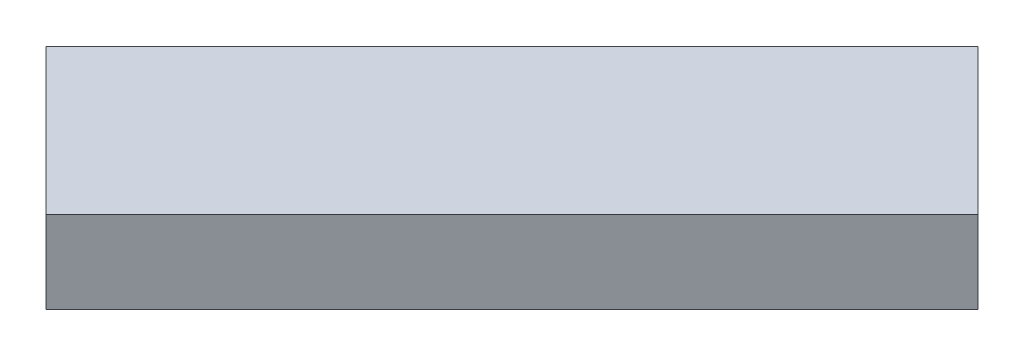
ISO-10303-21;
HEADER;
FILE_DESCRIPTION(('STEP AP214'),'2;1');
FILE_NAME('part.step','',(''),(''),'','','');
FILE_SCHEMA(('AUTOMOTIVE_DESIGN { 1 0 10303 214 1 1 1 1 }'));
ENDSEC;
DATA;
#1=APPLICATION_CONTEXT('core data for automotive mechanical design processes');
#2=APPLICATION_PROTOCOL_DEFINITION('international standard','automotive_design',2000,#1);
#3=PRODUCT_CONTEXT('',#1,'mechanical');
#4=PRODUCT('Part','Part','',(#3));
#5=PRODUCT_RELATED_PRODUCT_CATEGORY('part','',(#4));
#6=PRODUCT_DEFINITION_FORMATION('','',#4);
#7=PRODUCT_DEFINITION_CONTEXT('part definition',#1,'design');
#8=PRODUCT_DEFINITION('design','',#6,#7);
#9=PRODUCT_DEFINITION_SHAPE('','',#8);
#10=(LENGTH_UNIT() NAMED_UNIT(*) SI_UNIT(.MILLI.,.METRE.));
#11=(NAMED_UNIT(*) PLANE_ANGLE_UNIT() SI_UNIT($,.RADIAN.));
#12=(NAMED_UNIT(*) SI_UNIT($,.STERADIAN.) SOLID_ANGLE_UNIT());
#13=UNCERTAINTY_MEASURE_WITH_UNIT(LENGTH_MEASURE(1.E-05),#10,'distance_accuracy_value','');
#14=(GEOMETRIC_REPRESENTATION_CONTEXT(3) GLOBAL_UNCERTAINTY_ASSIGNED_CONTEXT((#13)) GLOBAL_UNIT_ASSIGNED_CONTEXT((#10,
#11,#12)) REPRESENTATION_CONTEXT('',''));
#15=CARTESIAN_POINT('',(0.,0.,0.));
#16=DIRECTION('',(0.,0.,1.));
#17=DIRECTION('',(1.,0.,0.));
#18=AXIS2_PLACEMENT_3D('',#15,#16,#17);
#19=CARTESIAN_POINT('',(0.,0.2,0.));
#20=DIRECTION('',(0.,1.,0.));
#21=DIRECTION('',(-1.,0.,0.));
#22=AXIS2_PLACEMENT_3D('',#19,#20,#21);
#23=PLANE('',#22);
#24=DIRECTION('',(0.707106781186541,0.,-0.707106781186554));
#25=VECTOR('',#24,1.);
#26=CARTESIAN_POINT('',(3.92426406871195,0.19999999999999,2.79289321881343));
#27=LINE('',#26,#25);
#28=CARTESIAN_POINT('',(2.79289321881348,0.199999999999986,3.92426406871191));
#29=VERTEX_POINT('',#28);
#30=CARTESIAN_POINT('',(3.92426406871195,0.19999999999999,2.79289321881343));
#31=VERTEX_POINT('',#30);
#32=EDGE_CURVE('E11',#29,#31,#27,.T.);
#33=ORIENTED_EDGE('',*,*,#32,.F.);
#34=DIRECTION('',(-0.707106781186548,0.,-0.707106781186547));
#35=VECTOR('',#34,1.);
#36=CARTESIAN_POINT('',(2.79289321881348,0.199999999999986,3.92426406871191));
#37=LINE('',#36,#35);
#38=CARTESIAN_POINT('',(3.14644660940675,0.199999999999985,4.27781745930519));
#39=VERTEX_POINT('',#38);
#40=EDGE_CURVE('E24',#39,#29,#37,.T.);
#41=ORIENTED_EDGE('',*,*,#40,.F.);
#42=DIRECTION('',(-0.707106781186547,0.,0.707106781186548));
#43=VECTOR('',#42,1.);
#44=CARTESIAN_POINT('',(3.14644660940675,0.199999999999985,4.27781745930519));
#45=LINE('',#44,#43);
#46=CARTESIAN_POINT('',(4.27781745930523,0.199999999999989,3.14644660940671));
#47=VERTEX_POINT('',#46);
#48=EDGE_CURVE('E75',#47,#39,#45,.T.);
#49=ORIENTED_EDGE('',*,*,#48,.F.);
#50=DIRECTION('',(0.707106781186551,0.,0.707106781186545));
#51=VECTOR('',#50,1.);
#52=CARTESIAN_POINT('',(4.27781745930523,0.199999999999989,3.14644660940671));
#53=LINE('',#52,#51);
#54=EDGE_CURVE('E85',#31,#47,#53,.T.);
#55=ORIENTED_EDGE('',*,*,#54,.F.);
#56=EDGE_LOOP('',(#33,#41,#49,#55));
#57=FACE_BOUND('',#56,.T.);
#58=ADVANCED_FACE('F17',(#57),#23,.T.);
#59=CARTESIAN_POINT('',(0.,0.,0.));
#60=DIRECTION('',(0.,1.,0.));
#61=DIRECTION('',(0.,0.,1.));
#62=AXIS2_PLACEMENT_3D('',#59,#60,#61);
#63=PLANE('',#62);
#64=DIRECTION('',(0.707106781186541,0.,-0.707106781186554));
#65=VECTOR('',#64,1.);
#66=CARTESIAN_POINT('',(3.92426406871195,0.,2.79289321881342));
#67=LINE('',#66,#65);
#68=CARTESIAN_POINT('',(2.79289321881348,0.,3.92426406871191));
#69=VERTEX_POINT('',#68);
#70=CARTESIAN_POINT('',(3.92426406871195,0.,2.79289321881342));
#71=VERTEX_POINT('',#70);
#72=EDGE_CURVE('E83',#69,#71,#67,.T.);
#73=ORIENTED_EDGE('',*,*,#72,.T.);
#74=DIRECTION('',(0.707106781186551,0.,0.707106781186545));
#75=VECTOR('',#74,1.);
#76=CARTESIAN_POINT('',(4.27781745930523,0.,3.1464466094067));
#77=LINE('',#76,#75);
#78=CARTESIAN_POINT('',(4.27781745930523,0.,3.1464466094067));
#79=VERTEX_POINT('',#78);
#80=EDGE_CURVE('E60',#71,#79,#77,.T.);
#81=ORIENTED_EDGE('',*,*,#80,.T.);
#82=DIRECTION('',(-0.707106781186547,0.,0.707106781186548));
#83=VECTOR('',#82,1.);
#84=CARTESIAN_POINT('',(3.14644660940675,0.,4.27781745930519));
#85=LINE('',#84,#83);
#86=CARTESIAN_POINT('',(3.14644660940675,0.,4.27781745930519));
#87=VERTEX_POINT('',#86);
#88=EDGE_CURVE('E54',#79,#87,#85,.T.);
#89=ORIENTED_EDGE('',*,*,#88,.T.);
#90=DIRECTION('',(-0.707106781186548,0.,-0.707106781186547));
#91=VECTOR('',#90,1.);
#92=CARTESIAN_POINT('',(2.79289321881348,0.,3.92426406871191));
#93=LINE('',#92,#91);
#94=EDGE_CURVE('E57',#87,#69,#93,.T.);
#95=ORIENTED_EDGE('',*,*,#94,.T.);
#96=EDGE_LOOP('',(#73,#81,#89,#95));
#97=FACE_BOUND('',#96,.T.);
#98=ADVANCED_FACE('F56',(#97),#63,.F.);
#99=CARTESIAN_POINT('',(4.27781745930523,4.22492235949961,3.14644660940672));
#100=DIRECTION('',(0.707106781186545,0.,-0.707106781186551));
#101=DIRECTION('',(-0.707106781186551,0.,-0.707106781186545));
#102=AXIS2_PLACEMENT_3D('',#99,#100,#101);
#103=PLANE('',#102);
#104=DIRECTION('',(0.,-1.,0.));
#105=VECTOR('',#104,1.);
#106=CARTESIAN_POINT('',(3.92426406871195,4.22492235949961,2.79289321881344));
#107=LINE('',#106,#105);
#108=EDGE_CURVE('E71',#31,#71,#107,.T.);
#109=ORIENTED_EDGE('',*,*,#108,.F.);
#110=ORIENTED_EDGE('',*,*,#54,.T.);
#111=DIRECTION('',(0.,-1.,0.));
#112=VECTOR('',#111,1.);
#113=CARTESIAN_POINT('',(4.27781745930523,4.22492235949961,3.14644660940672));
#114=LINE('',#113,#112);
#115=EDGE_CURVE('E76',#47,#79,#114,.T.);
#116=ORIENTED_EDGE('',*,*,#115,.T.);
#117=ORIENTED_EDGE('',*,*,#80,.F.);
#118=EDGE_LOOP('',(#109,#110,#116,#117));
#119=FACE_BOUND('',#118,.T.);
#120=ADVANCED_FACE('F91',(#119),#103,.T.);
#121=CARTESIAN_POINT('',(3.14644660940675,4.22492235949961,4.2778174593052));
#122=DIRECTION('',(0.707106781186548,0.,0.707106781186547));
#123=DIRECTION('',(0.707106781186547,0.,-0.707106781186548));
#124=AXIS2_PLACEMENT_3D('',#121,#122,#123);
#125=PLANE('',#124);
#126=ORIENTED_EDGE('',*,*,#115,.F.);
#127=ORIENTED_EDGE('',*,*,#48,.T.);
#128=DIRECTION('',(0.,-1.,0.));
#129=VECTOR('',#128,1.);
#130=CARTESIAN_POINT('',(3.14644660940675,4.22492235949961,4.2778174593052));
#131=LINE('',#130,#129);
#132=EDGE_CURVE('E69',#39,#87,#131,.T.);
#133=ORIENTED_EDGE('',*,*,#132,.T.);
#134=ORIENTED_EDGE('',*,*,#88,.F.);
#135=EDGE_LOOP('',(#126,#127,#133,#134));
#136=FACE_BOUND('',#135,.T.);
#137=ADVANCED_FACE('F74',(#136),#125,.T.);
#138=CARTESIAN_POINT('',(2.79289321881348,4.22492235949961,3.92426406871193));
#139=DIRECTION('',(-0.707106781186547,0.,0.707106781186548));
#140=DIRECTION('',(0.707106781186548,0.,0.707106781186547));
#141=AXIS2_PLACEMENT_3D('',#138,#139,#140);
#142=PLANE('',#141);
#143=ORIENTED_EDGE('',*,*,#132,.F.);
#144=ORIENTED_EDGE('',*,*,#40,.T.);
#145=DIRECTION('',(0.,-1.,0.));
#146=VECTOR('',#145,1.);
#147=CARTESIAN_POINT('',(2.79289321881348,4.22492235949961,3.92426406871193));
#148=LINE('',#147,#146);
#149=EDGE_CURVE('E70',#29,#69,#148,.T.);
#150=ORIENTED_EDGE('',*,*,#149,.T.);
#151=ORIENTED_EDGE('',*,*,#94,.F.);
#152=EDGE_LOOP('',(#143,#144,#150,#151));
#153=FACE_BOUND('',#152,.T.);
#154=ADVANCED_FACE('F68',(#153),#142,.T.);
#155=CARTESIAN_POINT('',(3.92426406871195,4.22492235949961,2.79289321881344));
#156=DIRECTION('',(-0.707106781186554,0.,-0.707106781186541));
#157=DIRECTION('',(-0.707106781186541,0.,0.707106781186554));
#158=AXIS2_PLACEMENT_3D('',#155,#156,#157);
#159=PLANE('',#158);
#160=ORIENTED_EDGE('',*,*,#149,.F.);
#161=ORIENTED_EDGE('',*,*,#32,.T.);
#162=ORIENTED_EDGE('',*,*,#108,.T.);
#163=ORIENTED_EDGE('',*,*,#72,.F.);
#164=EDGE_LOOP('',(#160,#161,#162,#163));
#165=FACE_BOUND('',#164,.T.);
#166=ADVANCED_FACE('F88',(#165),#159,.T.);
#167=CLOSED_SHELL('',(#58,#98,#120,#137,#154,#166));
#168=MANIFOLD_SOLID_BREP('B1',#167);
#169=ADVANCED_BREP_SHAPE_REPRESENTATION('',(#18,#168),#14);
#170=SHAPE_DEFINITION_REPRESENTATION(#9,#169);
ENDSEC;
END-ISO-10303-21;
